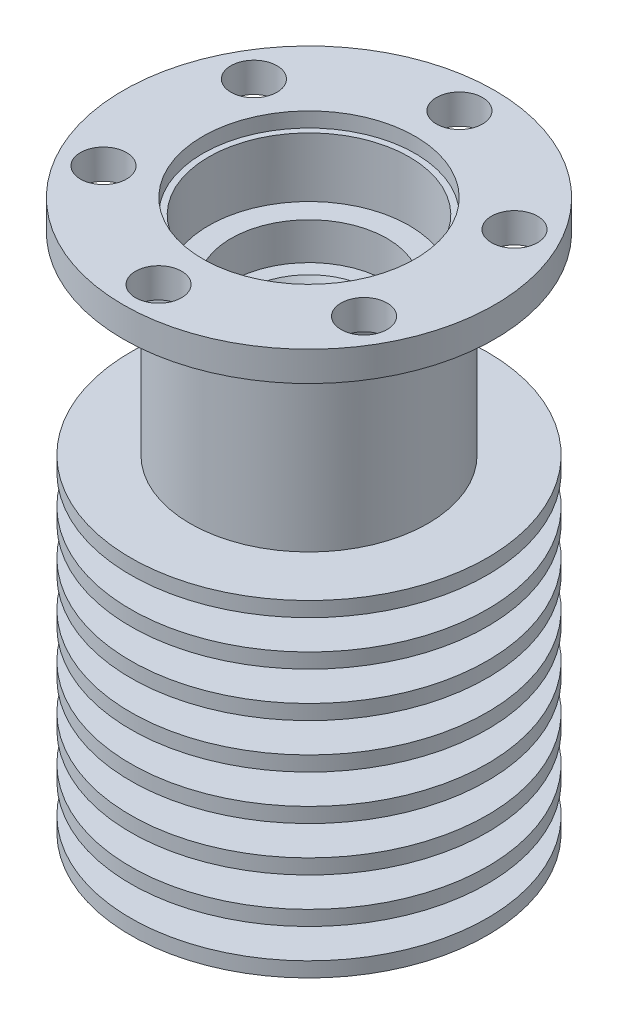
ISO-10303-21;
HEADER;
FILE_DESCRIPTION(('STEP AP214'),'2;1');
FILE_NAME('part.step','',(''),(''),'','','');
FILE_SCHEMA(('AUTOMOTIVE_DESIGN { 1 0 10303 214 1 1 1 1 }'));
ENDSEC;
DATA;
#1=APPLICATION_CONTEXT('core data for automotive mechanical design processes');
#2=APPLICATION_PROTOCOL_DEFINITION('international standard','automotive_design',2000,#1);
#3=PRODUCT_CONTEXT('',#1,'mechanical');
#4=PRODUCT('Part','Part','',(#3));
#5=PRODUCT_RELATED_PRODUCT_CATEGORY('part','',(#4));
#6=PRODUCT_DEFINITION_FORMATION('','',#4);
#7=PRODUCT_DEFINITION_CONTEXT('part definition',#1,'design');
#8=PRODUCT_DEFINITION('design','',#6,#7);
#9=PRODUCT_DEFINITION_SHAPE('','',#8);
#10=(LENGTH_UNIT() NAMED_UNIT(*) SI_UNIT(.MILLI.,.METRE.));
#11=(NAMED_UNIT(*) PLANE_ANGLE_UNIT() SI_UNIT($,.RADIAN.));
#12=(NAMED_UNIT(*) SI_UNIT($,.STERADIAN.) SOLID_ANGLE_UNIT());
#13=UNCERTAINTY_MEASURE_WITH_UNIT(LENGTH_MEASURE(1.E-05),#10,'distance_accuracy_value','');
#14=(GEOMETRIC_REPRESENTATION_CONTEXT(3) GLOBAL_UNCERTAINTY_ASSIGNED_CONTEXT((#13)) GLOBAL_UNIT_ASSIGNED_CONTEXT((#10,
#11,#12)) REPRESENTATION_CONTEXT('',''));
#15=CARTESIAN_POINT('',(0.,0.,0.));
#16=DIRECTION('',(0.,0.,1.));
#17=DIRECTION('',(1.,0.,0.));
#18=AXIS2_PLACEMENT_3D('',#15,#16,#17);
#19=CARTESIAN_POINT('',(0.,0.,0.));
#20=DIRECTION('',(0.,-1.,0.));
#21=DIRECTION('',(0.,0.,-1.));
#22=AXIS2_PLACEMENT_3D('',#19,#20,#21);
#23=CYLINDRICAL_SURFACE('',#22,6.75);
#24=CARTESIAN_POINT('',(0.,32.,0.));
#25=DIRECTION('',(0.,-1.,0.));
#26=DIRECTION('',(0.,0.,-1.));
#27=AXIS2_PLACEMENT_3D('',#24,#25,#26);
#28=CIRCLE('',#27,6.75);
#29=CARTESIAN_POINT('',(0.,32.,-6.75));
#30=VERTEX_POINT('',#29);
#31=EDGE_CURVE('E124',#30,#30,#28,.T.);
#32=ORIENTED_EDGE('',*,*,#31,.T.);
#33=EDGE_LOOP('',(#32));
#34=FACE_BOUND('',#33,.T.);
#35=CARTESIAN_POINT('',(0.,36.,0.));
#36=DIRECTION('',(0.,1.,0.));
#37=DIRECTION('',(-1.,0.,0.));
#38=AXIS2_PLACEMENT_3D('',#35,#36,#37);
#39=CIRCLE('',#38,6.75);
#40=CARTESIAN_POINT('',(-6.75,36.,0.));
#41=VERTEX_POINT('',#40);
#42=EDGE_CURVE('E57',#41,#41,#39,.F.);
#43=ORIENTED_EDGE('',*,*,#42,.F.);
#44=EDGE_LOOP('',(#43));
#45=FACE_BOUND('',#44,.T.);
#46=ADVANCED_FACE('F36',(#34,#45),#23,.F.);
#47=CARTESIAN_POINT('',(0.,37.,0.));
#48=DIRECTION('',(0.,1.,0.));
#49=DIRECTION('',(0.,0.,1.));
#50=AXIS2_PLACEMENT_3D('',#47,#48,#49);
#51=CYLINDRICAL_SURFACE('',#50,4.75);
#52=CARTESIAN_POINT('',(0.,21.,0.));
#53=DIRECTION('',(0.,-1.,0.));
#54=DIRECTION('',(0.,0.,-1.));
#55=AXIS2_PLACEMENT_3D('',#52,#53,#54);
#56=CIRCLE('',#55,4.75);
#57=CARTESIAN_POINT('',(0.,21.,-4.75));
#58=VERTEX_POINT('',#57);
#59=EDGE_CURVE('E178',#58,#58,#56,.T.);
#60=ORIENTED_EDGE('',*,*,#59,.T.);
#61=EDGE_LOOP('',(#60));
#62=FACE_BOUND('',#61,.T.);
#63=CARTESIAN_POINT('',(0.,19.,0.));
#64=DIRECTION('',(0.,-1.,0.));
#65=DIRECTION('',(0.,0.,-1.));
#66=AXIS2_PLACEMENT_3D('',#63,#64,#65);
#67=CIRCLE('',#66,4.75);
#68=CARTESIAN_POINT('',(0.,19.,-4.75));
#69=VERTEX_POINT('',#68);
#70=EDGE_CURVE('E67',#69,#69,#67,.T.);
#71=ORIENTED_EDGE('',*,*,#70,.F.);
#72=EDGE_LOOP('',(#71));
#73=FACE_BOUND('',#72,.T.);
#74=ADVANCED_FACE('F296',(#62,#73),#51,.T.);
#75=CARTESIAN_POINT('',(0.,18.,0.));
#76=DIRECTION('',(0.,-1.,0.));
#77=DIRECTION('',(0.,0.,-1.));
#78=AXIS2_PLACEMENT_3D('',#75,#76,#77);
#79=CIRCLE('',#78,4.75);
#80=CARTESIAN_POINT('',(0.,18.,-4.75));
#81=VERTEX_POINT('',#80);
#82=EDGE_CURVE('E162',#81,#81,#79,.T.);
#83=ORIENTED_EDGE('',*,*,#82,.T.);
#84=EDGE_LOOP('',(#83));
#85=FACE_BOUND('',#84,.T.);
#86=CARTESIAN_POINT('',(0.,16.,0.));
#87=DIRECTION('',(0.,-1.,0.));
#88=DIRECTION('',(0.,0.,-1.));
#89=AXIS2_PLACEMENT_3D('',#86,#87,#88);
#90=CIRCLE('',#89,4.75);
#91=CARTESIAN_POINT('',(0.,16.,-4.75));
#92=VERTEX_POINT('',#91);
#93=EDGE_CURVE('E71',#92,#92,#90,.T.);
#94=ORIENTED_EDGE('',*,*,#93,.F.);
#95=EDGE_LOOP('',(#94));
#96=FACE_BOUND('',#95,.T.);
#97=ADVANCED_FACE('F302',(#85,#96),#51,.T.);
#98=CARTESIAN_POINT('',(0.,15.,0.));
#99=DIRECTION('',(0.,-1.,0.));
#100=DIRECTION('',(0.,0.,-1.));
#101=AXIS2_PLACEMENT_3D('',#98,#99,#100);
#102=CIRCLE('',#101,4.75);
#103=CARTESIAN_POINT('',(0.,15.,-4.75));
#104=VERTEX_POINT('',#103);
#105=EDGE_CURVE('E151',#104,#104,#102,.T.);
#106=ORIENTED_EDGE('',*,*,#105,.T.);
#107=EDGE_LOOP('',(#106));
#108=FACE_BOUND('',#107,.T.);
#109=CARTESIAN_POINT('',(0.,13.,0.));
#110=DIRECTION('',(0.,-1.,0.));
#111=DIRECTION('',(0.,0.,-1.));
#112=AXIS2_PLACEMENT_3D('',#109,#110,#111);
#113=CIRCLE('',#112,4.75);
#114=CARTESIAN_POINT('',(0.,13.,-4.75));
#115=VERTEX_POINT('',#114);
#116=EDGE_CURVE('E68',#115,#115,#113,.T.);
#117=ORIENTED_EDGE('',*,*,#116,.F.);
#118=EDGE_LOOP('',(#117));
#119=FACE_BOUND('',#118,.T.);
#120=ADVANCED_FACE('F305',(#108,#119),#51,.T.);
#121=CARTESIAN_POINT('',(0.,37.,0.));
#122=DIRECTION('',(0.,1.,0.));
#123=DIRECTION('',(0.,0.,1.));
#124=AXIS2_PLACEMENT_3D('',#121,#122,#123);
#125=CYLINDRICAL_SURFACE('',#124,5.25);
#126=CARTESIAN_POINT('',(0.,12.,0.));
#127=DIRECTION('',(0.,1.,0.));
#128=DIRECTION('',(0.,0.,1.));
#129=AXIS2_PLACEMENT_3D('',#126,#127,#128);
#130=CIRCLE('',#129,5.25);
#131=CARTESIAN_POINT('',(0.,12.,5.25));
#132=VERTEX_POINT('',#131);
#133=EDGE_CURVE('E97',#132,#132,#130,.T.);
#134=ORIENTED_EDGE('',*,*,#133,.F.);
#135=EDGE_LOOP('',(#134));
#136=FACE_BOUND('',#135,.T.);
#137=CARTESIAN_POINT('',(0.,10.,0.));
#138=DIRECTION('',(0.,-1.,0.));
#139=DIRECTION('',(0.,0.,-1.));
#140=AXIS2_PLACEMENT_3D('',#137,#138,#139);
#141=CIRCLE('',#140,5.25);
#142=CARTESIAN_POINT('',(0.,10.,-5.25));
#143=VERTEX_POINT('',#142);
#144=EDGE_CURVE('E72',#143,#143,#141,.T.);
#145=ORIENTED_EDGE('',*,*,#144,.F.);
#146=EDGE_LOOP('',(#145));
#147=FACE_BOUND('',#146,.T.);
#148=ADVANCED_FACE('F346',(#136,#147),#125,.T.);
#149=CARTESIAN_POINT('',(0.,37.,0.));
#150=DIRECTION('',(0.,1.,0.));
#151=DIRECTION('',(0.,0.,1.));
#152=AXIS2_PLACEMENT_3D('',#149,#150,#151);
#153=CYLINDRICAL_SURFACE('',#152,6.);
#154=CARTESIAN_POINT('',(0.,9.,0.));
#155=DIRECTION('',(0.,1.,0.));
#156=DIRECTION('',(0.,0.,1.));
#157=AXIS2_PLACEMENT_3D('',#154,#155,#156);
#158=CIRCLE('',#157,6.);
#159=CARTESIAN_POINT('',(0.,9.,6.));
#160=VERTEX_POINT('',#159);
#161=EDGE_CURVE('E94',#160,#160,#158,.T.);
#162=ORIENTED_EDGE('',*,*,#161,.F.);
#163=EDGE_LOOP('',(#162));
#164=FACE_BOUND('',#163,.T.);
#165=CARTESIAN_POINT('',(0.,7.,0.));
#166=DIRECTION('',(0.,-1.,0.));
#167=DIRECTION('',(0.,0.,-1.));
#168=AXIS2_PLACEMENT_3D('',#165,#166,#167);
#169=CIRCLE('',#168,6.);
#170=CARTESIAN_POINT('',(0.,7.,-6.));
#171=VERTEX_POINT('',#170);
#172=EDGE_CURVE('E75',#171,#171,#169,.T.);
#173=ORIENTED_EDGE('',*,*,#172,.F.);
#174=EDGE_LOOP('',(#173));
#175=FACE_BOUND('',#174,.T.);
#176=ADVANCED_FACE('F350',(#164,#175),#153,.T.);
#177=CARTESIAN_POINT('',(0.,6.,0.));
#178=DIRECTION('',(0.,-1.,0.));
#179=DIRECTION('',(0.,0.,-1.));
#180=AXIS2_PLACEMENT_3D('',#177,#178,#179);
#181=CIRCLE('',#180,6.);
#182=CARTESIAN_POINT('',(0.,6.,-6.));
#183=VERTEX_POINT('',#182);
#184=EDGE_CURVE('E79',#183,#183,#181,.T.);
#185=ORIENTED_EDGE('',*,*,#184,.T.);
#186=EDGE_LOOP('',(#185));
#187=FACE_BOUND('',#186,.T.);
#188=CARTESIAN_POINT('',(0.,4.,0.));
#189=DIRECTION('',(0.,-1.,0.));
#190=DIRECTION('',(0.,0.,-1.));
#191=AXIS2_PLACEMENT_3D('',#188,#189,#190);
#192=CIRCLE('',#191,6.);
#193=CARTESIAN_POINT('',(0.,4.,-6.));
#194=VERTEX_POINT('',#193);
#195=EDGE_CURVE('E78',#194,#194,#192,.T.);
#196=ORIENTED_EDGE('',*,*,#195,.F.);
#197=EDGE_LOOP('',(#196));
#198=FACE_BOUND('',#197,.T.);
#199=ADVANCED_FACE('F354',(#187,#198),#153,.T.);
#200=CARTESIAN_POINT('',(0.,3.,0.));
#201=DIRECTION('',(0.,-1.,0.));
#202=DIRECTION('',(0.,0.,-1.));
#203=AXIS2_PLACEMENT_3D('',#200,#201,#202);
#204=CIRCLE('',#203,6.);
#205=CARTESIAN_POINT('',(0.,3.,-6.));
#206=VERTEX_POINT('',#205);
#207=EDGE_CURVE('E87',#206,#206,#204,.T.);
#208=ORIENTED_EDGE('',*,*,#207,.T.);
#209=EDGE_LOOP('',(#208));
#210=FACE_BOUND('',#209,.T.);
#211=CARTESIAN_POINT('',(0.,1.,0.));
#212=DIRECTION('',(0.,-1.,0.));
#213=DIRECTION('',(0.,0.,-1.));
#214=AXIS2_PLACEMENT_3D('',#211,#212,#213);
#215=CIRCLE('',#214,6.);
#216=CARTESIAN_POINT('',(0.,1.,-6.));
#217=VERTEX_POINT('',#216);
#218=EDGE_CURVE('E86',#217,#217,#215,.T.);
#219=ORIENTED_EDGE('',*,*,#218,.F.);
#220=EDGE_LOOP('',(#219));
#221=FACE_BOUND('',#220,.T.);
#222=ADVANCED_FACE('F273',(#210,#221),#153,.T.);
#223=CARTESIAN_POINT('',(0.,37.,0.));
#224=DIRECTION('',(0.,1.,0.));
#225=DIRECTION('',(0.,0.,1.));
#226=AXIS2_PLACEMENT_3D('',#223,#224,#225);
#227=CYLINDRICAL_SURFACE('',#226,8.);
#228=CARTESIAN_POINT('',(0.,35.,0.));
#229=DIRECTION('',(0.,1.,0.));
#230=DIRECTION('',(0.,0.,1.));
#231=AXIS2_PLACEMENT_3D('',#228,#229,#230);
#232=CIRCLE('',#231,8.);
#233=CARTESIAN_POINT('',(0.,35.,8.));
#234=VERTEX_POINT('',#233);
#235=EDGE_CURVE('E100',#234,#234,#232,.T.);
#236=ORIENTED_EDGE('',*,*,#235,.F.);
#237=EDGE_LOOP('',(#236));
#238=FACE_BOUND('',#237,.T.);
#239=CARTESIAN_POINT('',(0.,22.,0.));
#240=DIRECTION('',(0.,-1.,0.));
#241=DIRECTION('',(0.,0.,-1.));
#242=AXIS2_PLACEMENT_3D('',#239,#240,#241);
#243=CIRCLE('',#242,8.);
#244=CARTESIAN_POINT('',(0.,22.,-8.));
#245=VERTEX_POINT('',#244);
#246=EDGE_CURVE('E173',#245,#245,#243,.T.);
#247=ORIENTED_EDGE('',*,*,#246,.F.);
#248=EDGE_LOOP('',(#247));
#249=FACE_BOUND('',#248,.T.);
#250=ADVANCED_FACE('F266',(#238,#249),#227,.T.);
#251=CARTESIAN_POINT('',(8.,35.,0.));
#252=DIRECTION('',(0.,1.,0.));
#253=DIRECTION('',(0.,0.,1.));
#254=AXIS2_PLACEMENT_3D('',#251,#252,#253);
#255=PLANE('',#254);
#256=CARTESIAN_POINT('',(8.76850721331738,35.,-5.0625000000001));
#257=DIRECTION('',(0.,1.,0.));
#258=DIRECTION('',(0.,0.,1.));
#259=AXIS2_PLACEMENT_3D('',#256,#257,#258);
#260=CIRCLE('',#259,1.55);
#261=CARTESIAN_POINT('',(8.76850721331738,35.,-3.5125000000001));
#262=VERTEX_POINT('',#261);
#263=EDGE_CURVE('E215',#262,#262,#260,.F.);
#264=ORIENTED_EDGE('',*,*,#263,.F.);
#265=EDGE_LOOP('',(#264));
#266=FACE_BOUND('',#265,.T.);
#267=CARTESIAN_POINT('',(8.76850721331749,35.,5.06249999999992));
#268=DIRECTION('',(0.,1.,0.));
#269=DIRECTION('',(0.,0.,1.));
#270=AXIS2_PLACEMENT_3D('',#267,#268,#269);
#271=CIRCLE('',#270,1.55);
#272=CARTESIAN_POINT('',(8.76850721331749,35.,6.61249999999992));
#273=VERTEX_POINT('',#272);
#274=EDGE_CURVE('E209',#273,#273,#271,.F.);
#275=ORIENTED_EDGE('',*,*,#274,.F.);
#276=EDGE_LOOP('',(#275));
#277=FACE_BOUND('',#276,.T.);
#278=CARTESIAN_POINT('',(0.,35.,10.125));
#279=DIRECTION('',(0.,1.,0.));
#280=DIRECTION('',(0.,0.,1.));
#281=AXIS2_PLACEMENT_3D('',#278,#279,#280);
#282=CIRCLE('',#281,1.55);
#283=CARTESIAN_POINT('',(0.,35.,11.675));
#284=VERTEX_POINT('',#283);
#285=EDGE_CURVE('E203',#284,#284,#282,.F.);
#286=ORIENTED_EDGE('',*,*,#285,.F.);
#287=EDGE_LOOP('',(#286));
#288=FACE_BOUND('',#287,.T.);
#289=CARTESIAN_POINT('',(-8.76850721331742,35.,5.06250000000004));
#290=DIRECTION('',(0.,1.,0.));
#291=DIRECTION('',(0.,0.,1.));
#292=AXIS2_PLACEMENT_3D('',#289,#290,#291);
#293=CIRCLE('',#292,1.55);
#294=CARTESIAN_POINT('',(-8.76850721331742,35.,6.61250000000004));
#295=VERTEX_POINT('',#294);
#296=EDGE_CURVE('E197',#295,#295,#293,.F.);
#297=ORIENTED_EDGE('',*,*,#296,.F.);
#298=EDGE_LOOP('',(#297));
#299=FACE_BOUND('',#298,.T.);
#300=CARTESIAN_POINT('',(-8.76850721331745,35.,-5.06249999999998));
#301=DIRECTION('',(0.,1.,0.));
#302=DIRECTION('',(0.,0.,1.));
#303=AXIS2_PLACEMENT_3D('',#300,#301,#302);
#304=CIRCLE('',#303,1.55);
#305=CARTESIAN_POINT('',(-8.76850721331745,35.,-3.51249999999998));
#306=VERTEX_POINT('',#305);
#307=EDGE_CURVE('E191',#306,#306,#304,.F.);
#308=ORIENTED_EDGE('',*,*,#307,.F.);
#309=EDGE_LOOP('',(#308));
#310=FACE_BOUND('',#309,.T.);
#311=CARTESIAN_POINT('',(0.,35.,-10.125));
#312=DIRECTION('',(0.,1.,0.));
#313=DIRECTION('',(0.,0.,1.));
#314=AXIS2_PLACEMENT_3D('',#311,#312,#313);
#315=CIRCLE('',#314,1.55);
#316=CARTESIAN_POINT('',(0.,35.,-8.575));
#317=VERTEX_POINT('',#316);
#318=EDGE_CURVE('E185',#317,#317,#315,.F.);
#319=ORIENTED_EDGE('',*,*,#318,.F.);
#320=EDGE_LOOP('',(#319));
#321=FACE_BOUND('',#320,.T.);
#322=CARTESIAN_POINT('',(0.,35.,0.));
#323=DIRECTION('',(0.,1.,0.));
#324=DIRECTION('',(0.,0.,1.));
#325=AXIS2_PLACEMENT_3D('',#322,#323,#324);
#326=CIRCLE('',#325,12.5);
#327=CARTESIAN_POINT('',(0.,35.,12.5));
#328=VERTEX_POINT('',#327);
#329=EDGE_CURVE('E103',#328,#328,#326,.T.);
#330=ORIENTED_EDGE('',*,*,#329,.F.);
#331=EDGE_LOOP('',(#330));
#332=FACE_BOUND('',#331,.T.);
#333=ORIENTED_EDGE('',*,*,#235,.T.);
#334=EDGE_LOOP('',(#333));
#335=FACE_BOUND('',#334,.T.);
#336=ADVANCED_FACE('F260',(#266,#277,#288,#299,#310,#321,#332,#335),#255,.F.);
#337=CARTESIAN_POINT('',(0.,37.,0.));
#338=DIRECTION('',(0.,1.,0.));
#339=DIRECTION('',(0.,0.,1.));
#340=AXIS2_PLACEMENT_3D('',#337,#338,#339);
#341=CYLINDRICAL_SURFACE('',#340,12.5);
#342=CARTESIAN_POINT('',(0.,37.,0.));
#343=DIRECTION('',(0.,1.,0.));
#344=DIRECTION('',(0.,0.,1.));
#345=AXIS2_PLACEMENT_3D('',#342,#343,#344);
#346=CIRCLE('',#345,12.5);
#347=CARTESIAN_POINT('',(0.,37.,12.5));
#348=VERTEX_POINT('',#347);
#349=EDGE_CURVE('E106',#348,#348,#346,.T.);
#350=ORIENTED_EDGE('',*,*,#349,.F.);
#351=EDGE_LOOP('',(#350));
#352=FACE_BOUND('',#351,.T.);
#353=ORIENTED_EDGE('',*,*,#329,.T.);
#354=EDGE_LOOP('',(#353));
#355=FACE_BOUND('',#354,.T.);
#356=ADVANCED_FACE('F242',(#352,#355),#341,.T.);
#357=CARTESIAN_POINT('',(12.5,37.,0.));
#358=DIRECTION('',(0.,-1.,0.));
#359=DIRECTION('',(0.,0.,-1.));
#360=AXIS2_PLACEMENT_3D('',#357,#358,#359);
#361=PLANE('',#360);
#362=CARTESIAN_POINT('',(0.,37.,0.));
#363=DIRECTION('',(0.,1.,0.));
#364=DIRECTION('',(-1.,0.,0.));
#365=AXIS2_PLACEMENT_3D('',#362,#363,#364);
#366=CIRCLE('',#365,7.15);
#367=CARTESIAN_POINT('',(-7.15,37.,0.));
#368=VERTEX_POINT('',#367);
#369=EDGE_CURVE('E222',#368,#368,#366,.T.);
#370=ORIENTED_EDGE('',*,*,#369,.F.);
#371=EDGE_LOOP('',(#370));
#372=FACE_BOUND('',#371,.T.);
#373=CARTESIAN_POINT('',(8.76850721331738,37.,-5.0625000000001));
#374=DIRECTION('',(0.,1.,0.));
#375=DIRECTION('',(-0.50000000000001,0.,-0.866025403784433));
#376=AXIS2_PLACEMENT_3D('',#373,#374,#375);
#377=CIRCLE('',#376,1.55);
#378=CARTESIAN_POINT('',(7.99350721331737,37.,-6.40483937586597));
#379=VERTEX_POINT('',#378);
#380=EDGE_CURVE('E60',#379,#379,#377,.T.);
#381=ORIENTED_EDGE('',*,*,#380,.F.);
#382=EDGE_LOOP('',(#381));
#383=FACE_BOUND('',#382,.T.);
#384=CARTESIAN_POINT('',(8.76850721331749,37.,5.06249999999992));
#385=DIRECTION('',(0.,1.,0.));
#386=DIRECTION('',(0.499999999999992,0.,-0.866025403784443));
#387=AXIS2_PLACEMENT_3D('',#384,#385,#386);
#388=CIRCLE('',#387,1.55);
#389=CARTESIAN_POINT('',(9.54350721331748,37.,3.72016062413403));
#390=VERTEX_POINT('',#389);
#391=EDGE_CURVE('E212',#390,#390,#388,.T.);
#392=ORIENTED_EDGE('',*,*,#391,.F.);
#393=EDGE_LOOP('',(#392));
#394=FACE_BOUND('',#393,.T.);
#395=CARTESIAN_POINT('',(0.,37.,10.125));
#396=DIRECTION('',(0.,1.,0.));
#397=DIRECTION('',(1.,0.,0.));
#398=AXIS2_PLACEMENT_3D('',#395,#396,#397);
#399=CIRCLE('',#398,1.55);
#400=CARTESIAN_POINT('',(1.55,37.,10.125));
#401=VERTEX_POINT('',#400);
#402=EDGE_CURVE('E206',#401,#401,#399,.T.);
#403=ORIENTED_EDGE('',*,*,#402,.F.);
#404=EDGE_LOOP('',(#403));
#405=FACE_BOUND('',#404,.T.);
#406=CARTESIAN_POINT('',(-8.76850721331742,37.,5.06250000000004));
#407=DIRECTION('',(0.,1.,0.));
#408=DIRECTION('',(0.500000000000004,0.,0.866025403784436));
#409=AXIS2_PLACEMENT_3D('',#406,#407,#408);
#410=CIRCLE('',#409,1.55);
#411=CARTESIAN_POINT('',(-7.99350721331741,37.,6.40483937586592));
#412=VERTEX_POINT('',#411);
#413=EDGE_CURVE('E200',#412,#412,#410,.T.);
#414=ORIENTED_EDGE('',*,*,#413,.F.);
#415=EDGE_LOOP('',(#414));
#416=FACE_BOUND('',#415,.T.);
#417=CARTESIAN_POINT('',(-8.76850721331745,37.,-5.06249999999998));
#418=DIRECTION('',(0.,1.,0.));
#419=DIRECTION('',(-0.499999999999998,0.,0.86602540378444));
#420=AXIS2_PLACEMENT_3D('',#417,#418,#419);
#421=CIRCLE('',#420,1.55);
#422=CARTESIAN_POINT('',(-9.54350721331745,37.,-3.7201606241341));
#423=VERTEX_POINT('',#422);
#424=EDGE_CURVE('E194',#423,#423,#421,.T.);
#425=ORIENTED_EDGE('',*,*,#424,.F.);
#426=EDGE_LOOP('',(#425));
#427=FACE_BOUND('',#426,.T.);
#428=CARTESIAN_POINT('',(0.,37.,-10.125));
#429=DIRECTION('',(0.,1.,0.));
#430=DIRECTION('',(-1.,0.,0.));
#431=AXIS2_PLACEMENT_3D('',#428,#429,#430);
#432=CIRCLE('',#431,1.55);
#433=CARTESIAN_POINT('',(-1.55,37.,-10.125));
#434=VERTEX_POINT('',#433);
#435=EDGE_CURVE('E188',#434,#434,#432,.T.);
#436=ORIENTED_EDGE('',*,*,#435,.F.);
#437=EDGE_LOOP('',(#436));
#438=FACE_BOUND('',#437,.T.);
#439=ORIENTED_EDGE('',*,*,#349,.T.);
#440=EDGE_LOOP('',(#439));
#441=FACE_BOUND('',#440,.T.);
#442=ADVANCED_FACE('F238',(#372,#383,#394,#405,#416,#427,#438,#441),#361,.F.);
#443=CARTESIAN_POINT('',(0.,0.,0.));
#444=DIRECTION('',(0.,1.,0.));
#445=DIRECTION('',(0.,0.,1.));
#446=AXIS2_PLACEMENT_3D('',#443,#444,#445);
#447=PLANE('',#446);
#448=CARTESIAN_POINT('',(0.,0.,0.));
#449=DIRECTION('',(0.,-1.,0.));
#450=DIRECTION('',(0.,0.,-1.));
#451=AXIS2_PLACEMENT_3D('',#448,#449,#450);
#452=CIRCLE('',#451,2.5);
#453=CARTESIAN_POINT('',(0.,0.,-2.5));
#454=VERTEX_POINT('',#453);
#455=EDGE_CURVE('E109',#454,#454,#452,.T.);
#456=ORIENTED_EDGE('',*,*,#455,.F.);
#457=EDGE_LOOP('',(#456));
#458=FACE_BOUND('',#457,.T.);
#459=CARTESIAN_POINT('',(0.,0.,0.));
#460=DIRECTION('',(0.,-1.,0.));
#461=DIRECTION('',(0.,0.,-1.));
#462=AXIS2_PLACEMENT_3D('',#459,#460,#461);
#463=CIRCLE('',#462,12.);
#464=CARTESIAN_POINT('',(0.,0.,-12.));
#465=VERTEX_POINT('',#464);
#466=EDGE_CURVE('E90',#465,#465,#463,.T.);
#467=ORIENTED_EDGE('',*,*,#466,.T.);
#468=EDGE_LOOP('',(#467));
#469=FACE_BOUND('',#468,.T.);
#470=ADVANCED_FACE('F241',(#458,#469),#447,.F.);
#471=CARTESIAN_POINT('',(0.,0.,0.));
#472=DIRECTION('',(0.,-1.,0.));
#473=DIRECTION('',(0.,0.,-1.));
#474=AXIS2_PLACEMENT_3D('',#471,#472,#473);
#475=CYLINDRICAL_SURFACE('',#474,2.5);
#476=CARTESIAN_POINT('',(0.,12.,0.));
#477=DIRECTION('',(0.,-1.,0.));
#478=DIRECTION('',(0.,0.,-1.));
#479=AXIS2_PLACEMENT_3D('',#476,#477,#478);
#480=CIRCLE('',#479,2.5);
#481=CARTESIAN_POINT('',(0.,12.,-2.5));
#482=VERTEX_POINT('',#481);
#483=EDGE_CURVE('E112',#482,#482,#480,.T.);
#484=ORIENTED_EDGE('',*,*,#483,.F.);
#485=EDGE_LOOP('',(#484));
#486=FACE_BOUND('',#485,.T.);
#487=ORIENTED_EDGE('',*,*,#455,.T.);
#488=EDGE_LOOP('',(#487));
#489=FACE_BOUND('',#488,.T.);
#490=ADVANCED_FACE('F337',(#486,#489),#475,.F.);
#491=CARTESIAN_POINT('',(2.5,12.,0.));
#492=DIRECTION('',(0.,1.,0.));
#493=DIRECTION('',(0.,0.,1.));
#494=AXIS2_PLACEMENT_3D('',#491,#492,#493);
#495=PLANE('',#494);
#496=CARTESIAN_POINT('',(0.,12.,0.));
#497=DIRECTION('',(0.,1.,0.));
#498=DIRECTION('',(0.,0.,1.));
#499=AXIS2_PLACEMENT_3D('',#496,#497,#498);
#500=CIRCLE('',#499,1.85);
#501=CARTESIAN_POINT('',(0.,12.,1.85));
#502=VERTEX_POINT('',#501);
#503=EDGE_CURVE('E47',#502,#502,#500,.T.);
#504=ORIENTED_EDGE('',*,*,#503,.T.);
#505=EDGE_LOOP('',(#504));
#506=FACE_BOUND('',#505,.T.);
#507=ORIENTED_EDGE('',*,*,#483,.T.);
#508=EDGE_LOOP('',(#507));
#509=FACE_BOUND('',#508,.T.);
#510=ADVANCED_FACE('F333',(#506,#509),#495,.F.);
#511=CARTESIAN_POINT('',(0.,0.,0.));
#512=DIRECTION('',(0.,-1.,0.));
#513=DIRECTION('',(0.,0.,-1.));
#514=AXIS2_PLACEMENT_3D('',#511,#512,#513);
#515=CYLINDRICAL_SURFACE('',#514,1.7);
#516=CARTESIAN_POINT('',(0.,12.2598076211353,0.));
#517=DIRECTION('',(0.,1.,0.));
#518=DIRECTION('',(0.,0.,1.));
#519=AXIS2_PLACEMENT_3D('',#516,#517,#518);
#520=CIRCLE('',#519,1.7);
#521=CARTESIAN_POINT('',(0.,12.2598076211353,1.7));
#522=VERTEX_POINT('',#521);
#523=EDGE_CURVE('E51',#522,#522,#520,.F.);
#524=ORIENTED_EDGE('',*,*,#523,.T.);
#525=EDGE_LOOP('',(#524));
#526=FACE_BOUND('',#525,.T.);
#527=CARTESIAN_POINT('',(0.,13.4803847577293,0.));
#528=DIRECTION('',(0.,-1.,0.));
#529=DIRECTION('',(0.,0.,-1.));
#530=AXIS2_PLACEMENT_3D('',#527,#528,#529);
#531=CIRCLE('',#530,1.7);
#532=CARTESIAN_POINT('',(0.,13.4803847577293,-1.7));
#533=VERTEX_POINT('',#532);
#534=EDGE_CURVE('E56',#533,#533,#531,.F.);
#535=ORIENTED_EDGE('',*,*,#534,.T.);
#536=EDGE_LOOP('',(#535));
#537=FACE_BOUND('',#536,.T.);
#538=ADVANCED_FACE('F329',(#526,#537),#515,.F.);
#539=CARTESIAN_POINT('',(1.7,14.,0.));
#540=DIRECTION('',(0.,-1.,0.));
#541=DIRECTION('',(0.,0.,-1.));
#542=AXIS2_PLACEMENT_3D('',#539,#540,#541);
#543=PLANE('',#542);
#544=CARTESIAN_POINT('',(0.,14.,0.));
#545=DIRECTION('',(0.,-1.,0.));
#546=DIRECTION('',(0.,0.,-1.));
#547=AXIS2_PLACEMENT_3D('',#544,#545,#546);
#548=CIRCLE('',#547,2.00000000000001);
#549=CARTESIAN_POINT('',(0.,14.,-2.00000000000001));
#550=VERTEX_POINT('',#549);
#551=EDGE_CURVE('E64',#550,#550,#548,.T.);
#552=ORIENTED_EDGE('',*,*,#551,.T.);
#553=EDGE_LOOP('',(#552));
#554=FACE_BOUND('',#553,.T.);
#555=CARTESIAN_POINT('',(0.,14.,0.));
#556=DIRECTION('',(0.,-1.,0.));
#557=DIRECTION('',(0.,0.,-1.));
#558=AXIS2_PLACEMENT_3D('',#555,#556,#557);
#559=CIRCLE('',#558,3.25);
#560=CARTESIAN_POINT('',(0.,14.,-3.25));
#561=VERTEX_POINT('',#560);
#562=EDGE_CURVE('E115',#561,#561,#559,.T.);
#563=ORIENTED_EDGE('',*,*,#562,.F.);
#564=EDGE_LOOP('',(#563));
#565=FACE_BOUND('',#564,.T.);
#566=ADVANCED_FACE('F326',(#554,#565),#543,.F.);
#567=CARTESIAN_POINT('',(0.,0.,0.));
#568=DIRECTION('',(0.,-1.,0.));
#569=DIRECTION('',(0.,0.,-1.));
#570=AXIS2_PLACEMENT_3D('',#567,#568,#569);
#571=CYLINDRICAL_SURFACE('',#570,3.25);
#572=CARTESIAN_POINT('',(0.,27.7679491924311,0.));
#573=DIRECTION('',(0.,-1.,0.));
#574=DIRECTION('',(0.,0.,-1.));
#575=AXIS2_PLACEMENT_3D('',#572,#573,#574);
#576=CIRCLE('',#575,3.25);
#577=CARTESIAN_POINT('',(0.,27.7679491924311,-3.25));
#578=VERTEX_POINT('',#577);
#579=EDGE_CURVE('E10',#578,#578,#576,.F.);
#580=ORIENTED_EDGE('',*,*,#579,.T.);
#581=EDGE_LOOP('',(#580));
#582=FACE_BOUND('',#581,.T.);
#583=ORIENTED_EDGE('',*,*,#562,.T.);
#584=EDGE_LOOP('',(#583));
#585=FACE_BOUND('',#584,.T.);
#586=ADVANCED_FACE('F323',(#582,#585),#571,.F.);
#587=CARTESIAN_POINT('',(3.25,29.5,0.));
#588=DIRECTION('',(0.,-1.,0.));
#589=DIRECTION('',(0.,0.,-1.));
#590=AXIS2_PLACEMENT_3D('',#587,#588,#589);
#591=PLANE('',#590);
#592=CARTESIAN_POINT('',(0.,29.5,0.));
#593=DIRECTION('',(0.,-1.,0.));
#594=DIRECTION('',(0.,0.,-1.));
#595=AXIS2_PLACEMENT_3D('',#592,#593,#594);
#596=CIRCLE('',#595,4.25000000000001);
#597=CARTESIAN_POINT('',(0.,29.5,-4.25000000000001));
#598=VERTEX_POINT('',#597);
#599=EDGE_CURVE('E43',#598,#598,#596,.T.);
#600=ORIENTED_EDGE('',*,*,#599,.T.);
#601=EDGE_LOOP('',(#600));
#602=FACE_BOUND('',#601,.T.);
#603=CARTESIAN_POINT('',(0.,29.5,0.));
#604=DIRECTION('',(0.,-1.,0.));
#605=DIRECTION('',(0.,0.,-1.));
#606=AXIS2_PLACEMENT_3D('',#603,#604,#605);
#607=CIRCLE('',#606,5.25);
#608=CARTESIAN_POINT('',(0.,29.5,-5.25));
#609=VERTEX_POINT('',#608);
#610=EDGE_CURVE('E118',#609,#609,#607,.T.);
#611=ORIENTED_EDGE('',*,*,#610,.F.);
#612=EDGE_LOOP('',(#611));
#613=FACE_BOUND('',#612,.T.);
#614=ADVANCED_FACE('F319',(#602,#613),#591,.F.);
#615=CARTESIAN_POINT('',(0.,0.,0.));
#616=DIRECTION('',(0.,-1.,0.));
#617=DIRECTION('',(0.,0.,-1.));
#618=AXIS2_PLACEMENT_3D('',#615,#616,#617);
#619=CYLINDRICAL_SURFACE('',#618,5.25);
#620=CARTESIAN_POINT('',(0.,32.,0.));
#621=DIRECTION('',(0.,-1.,0.));
#622=DIRECTION('',(0.,0.,-1.));
#623=AXIS2_PLACEMENT_3D('',#620,#621,#622);
#624=CIRCLE('',#623,5.25);
#625=CARTESIAN_POINT('',(0.,32.,-5.25));
#626=VERTEX_POINT('',#625);
#627=EDGE_CURVE('E121',#626,#626,#624,.T.);
#628=ORIENTED_EDGE('',*,*,#627,.F.);
#629=EDGE_LOOP('',(#628));
#630=FACE_BOUND('',#629,.T.);
#631=ORIENTED_EDGE('',*,*,#610,.T.);
#632=EDGE_LOOP('',(#631));
#633=FACE_BOUND('',#632,.T.);
#634=ADVANCED_FACE('F315',(#630,#633),#619,.F.);
#635=CARTESIAN_POINT('',(5.25,32.,0.));
#636=DIRECTION('',(0.,-1.,0.));
#637=DIRECTION('',(0.,0.,-1.));
#638=AXIS2_PLACEMENT_3D('',#635,#636,#637);
#639=PLANE('',#638);
#640=ORIENTED_EDGE('',*,*,#31,.F.);
#641=EDGE_LOOP('',(#640));
#642=FACE_BOUND('',#641,.T.);
#643=ORIENTED_EDGE('',*,*,#627,.T.);
#644=EDGE_LOOP('',(#643));
#645=FACE_BOUND('',#644,.T.);
#646=ADVANCED_FACE('F311',(#642,#645),#639,.F.);
#647=CARTESIAN_POINT('',(0.,1.,0.));
#648=DIRECTION('',(0.,-1.,0.));
#649=DIRECTION('',(0.,0.,-1.));
#650=AXIS2_PLACEMENT_3D('',#647,#648,#649);
#651=PLANE('',#650);
#652=CARTESIAN_POINT('',(0.,1.,0.));
#653=DIRECTION('',(0.,-1.,0.));
#654=DIRECTION('',(0.,0.,-1.));
#655=AXIS2_PLACEMENT_3D('',#652,#653,#654);
#656=CIRCLE('',#655,12.);
#657=CARTESIAN_POINT('',(0.,1.,-12.));
#658=VERTEX_POINT('',#657);
#659=EDGE_CURVE('E127',#658,#658,#656,.T.);
#660=ORIENTED_EDGE('',*,*,#659,.F.);
#661=EDGE_LOOP('',(#660));
#662=FACE_BOUND('',#661,.T.);
#663=ORIENTED_EDGE('',*,*,#218,.T.);
#664=EDGE_LOOP('',(#663));
#665=FACE_BOUND('',#664,.T.);
#666=ADVANCED_FACE('F314',(#662,#665),#651,.F.);
#667=CARTESIAN_POINT('',(0.,1.,0.));
#668=DIRECTION('',(0.,-1.,0.));
#669=DIRECTION('',(0.,0.,-1.));
#670=AXIS2_PLACEMENT_3D('',#667,#668,#669);
#671=CYLINDRICAL_SURFACE('',#670,12.);
#672=ORIENTED_EDGE('',*,*,#659,.T.);
#673=EDGE_LOOP('',(#672));
#674=FACE_BOUND('',#673,.T.);
#675=ORIENTED_EDGE('',*,*,#466,.F.);
#676=EDGE_LOOP('',(#675));
#677=FACE_BOUND('',#676,.T.);
#678=ADVANCED_FACE('F309',(#674,#677),#671,.T.);
#679=CARTESIAN_POINT('',(0.,4.,0.));
#680=DIRECTION('',(0.,-1.,0.));
#681=DIRECTION('',(0.,0.,-1.));
#682=AXIS2_PLACEMENT_3D('',#679,#680,#681);
#683=PLANE('',#682);
#684=CARTESIAN_POINT('',(0.,4.,0.));
#685=DIRECTION('',(0.,-1.,0.));
#686=DIRECTION('',(0.,0.,-1.));
#687=AXIS2_PLACEMENT_3D('',#684,#685,#686);
#688=CIRCLE('',#687,12.);
#689=CARTESIAN_POINT('',(0.,4.,-12.));
#690=VERTEX_POINT('',#689);
#691=EDGE_CURVE('E91',#690,#690,#688,.T.);
#692=ORIENTED_EDGE('',*,*,#691,.F.);
#693=EDGE_LOOP('',(#692));
#694=FACE_BOUND('',#693,.T.);
#695=ORIENTED_EDGE('',*,*,#195,.T.);
#696=EDGE_LOOP('',(#695));
#697=FACE_BOUND('',#696,.T.);
#698=ADVANCED_FACE('F384',(#694,#697),#683,.F.);
#699=CARTESIAN_POINT('',(0.,3.,0.));
#700=DIRECTION('',(0.,-1.,0.));
#701=DIRECTION('',(0.,0.,-1.));
#702=AXIS2_PLACEMENT_3D('',#699,#700,#701);
#703=PLANE('',#702);
#704=CARTESIAN_POINT('',(0.,3.,0.));
#705=DIRECTION('',(0.,-1.,0.));
#706=DIRECTION('',(0.,0.,-1.));
#707=AXIS2_PLACEMENT_3D('',#704,#705,#706);
#708=CIRCLE('',#707,12.);
#709=CARTESIAN_POINT('',(0.,3.,-12.));
#710=VERTEX_POINT('',#709);
#711=EDGE_CURVE('E82',#710,#710,#708,.T.);
#712=ORIENTED_EDGE('',*,*,#711,.T.);
#713=EDGE_LOOP('',(#712));
#714=FACE_BOUND('',#713,.T.);
#715=ORIENTED_EDGE('',*,*,#207,.F.);
#716=EDGE_LOOP('',(#715));
#717=FACE_BOUND('',#716,.T.);
#718=ADVANCED_FACE('F390',(#714,#717),#703,.T.);
#719=CARTESIAN_POINT('',(0.,4.,0.));
#720=DIRECTION('',(0.,-1.,0.));
#721=DIRECTION('',(0.,0.,-1.));
#722=AXIS2_PLACEMENT_3D('',#719,#720,#721);
#723=CYLINDRICAL_SURFACE('',#722,12.);
#724=ORIENTED_EDGE('',*,*,#691,.T.);
#725=EDGE_LOOP('',(#724));
#726=FACE_BOUND('',#725,.T.);
#727=ORIENTED_EDGE('',*,*,#711,.F.);
#728=EDGE_LOOP('',(#727));
#729=FACE_BOUND('',#728,.T.);
#730=ADVANCED_FACE('F401',(#726,#729),#723,.T.);
#731=CARTESIAN_POINT('',(0.,7.,0.));
#732=DIRECTION('',(0.,-1.,0.));
#733=DIRECTION('',(0.,0.,-1.));
#734=AXIS2_PLACEMENT_3D('',#731,#732,#733);
#735=PLANE('',#734);
#736=CARTESIAN_POINT('',(0.,7.,0.));
#737=DIRECTION('',(0.,-1.,0.));
#738=DIRECTION('',(0.,0.,-1.));
#739=AXIS2_PLACEMENT_3D('',#736,#737,#738);
#740=CIRCLE('',#739,12.);
#741=CARTESIAN_POINT('',(0.,7.,-12.));
#742=VERTEX_POINT('',#741);
#743=EDGE_CURVE('E83',#742,#742,#740,.T.);
#744=ORIENTED_EDGE('',*,*,#743,.F.);
#745=EDGE_LOOP('',(#744));
#746=FACE_BOUND('',#745,.T.);
#747=ORIENTED_EDGE('',*,*,#172,.T.);
#748=EDGE_LOOP('',(#747));
#749=FACE_BOUND('',#748,.T.);
#750=ADVANCED_FACE('F404',(#746,#749),#735,.F.);
#751=CARTESIAN_POINT('',(0.,6.,0.));
#752=DIRECTION('',(0.,-1.,0.));
#753=DIRECTION('',(0.,0.,-1.));
#754=AXIS2_PLACEMENT_3D('',#751,#752,#753);
#755=PLANE('',#754);
#756=CARTESIAN_POINT('',(0.,6.,0.));
#757=DIRECTION('',(0.,-1.,0.));
#758=DIRECTION('',(0.,0.,-1.));
#759=AXIS2_PLACEMENT_3D('',#756,#757,#758);
#760=CIRCLE('',#759,12.);
#761=CARTESIAN_POINT('',(0.,6.,-12.));
#762=VERTEX_POINT('',#761);
#763=EDGE_CURVE('E136',#762,#762,#760,.T.);
#764=ORIENTED_EDGE('',*,*,#763,.T.);
#765=EDGE_LOOP('',(#764));
#766=FACE_BOUND('',#765,.T.);
#767=ORIENTED_EDGE('',*,*,#184,.F.);
#768=EDGE_LOOP('',(#767));
#769=FACE_BOUND('',#768,.T.);
#770=ADVANCED_FACE('F413',(#766,#769),#755,.T.);
#771=CARTESIAN_POINT('',(0.,7.,0.));
#772=DIRECTION('',(0.,-1.,0.));
#773=DIRECTION('',(0.,0.,-1.));
#774=AXIS2_PLACEMENT_3D('',#771,#772,#773);
#775=CYLINDRICAL_SURFACE('',#774,12.);
#776=ORIENTED_EDGE('',*,*,#743,.T.);
#777=EDGE_LOOP('',(#776));
#778=FACE_BOUND('',#777,.T.);
#779=ORIENTED_EDGE('',*,*,#763,.F.);
#780=EDGE_LOOP('',(#779));
#781=FACE_BOUND('',#780,.T.);
#782=ADVANCED_FACE('F409',(#778,#781),#775,.T.);
#783=CARTESIAN_POINT('',(0.,10.,0.));
#784=DIRECTION('',(0.,-1.,0.));
#785=DIRECTION('',(0.,0.,-1.));
#786=AXIS2_PLACEMENT_3D('',#783,#784,#785);
#787=PLANE('',#786);
#788=CARTESIAN_POINT('',(0.,10.,0.));
#789=DIRECTION('',(0.,-1.,0.));
#790=DIRECTION('',(0.,0.,-1.));
#791=AXIS2_PLACEMENT_3D('',#788,#789,#790);
#792=CIRCLE('',#791,12.);
#793=CARTESIAN_POINT('',(0.,10.,-12.));
#794=VERTEX_POINT('',#793);
#795=EDGE_CURVE('E139',#794,#794,#792,.T.);
#796=ORIENTED_EDGE('',*,*,#795,.F.);
#797=EDGE_LOOP('',(#796));
#798=FACE_BOUND('',#797,.T.);
#799=ORIENTED_EDGE('',*,*,#144,.T.);
#800=EDGE_LOOP('',(#799));
#801=FACE_BOUND('',#800,.T.);
#802=ADVANCED_FACE('F412',(#798,#801),#787,.F.);
#803=CARTESIAN_POINT('',(0.,9.,0.));
#804=DIRECTION('',(0.,-1.,0.));
#805=DIRECTION('',(0.,0.,-1.));
#806=AXIS2_PLACEMENT_3D('',#803,#804,#805);
#807=PLANE('',#806);
#808=CARTESIAN_POINT('',(0.,9.,0.));
#809=DIRECTION('',(0.,-1.,0.));
#810=DIRECTION('',(0.,0.,-1.));
#811=AXIS2_PLACEMENT_3D('',#808,#809,#810);
#812=CIRCLE('',#811,12.);
#813=CARTESIAN_POINT('',(0.,9.,-12.));
#814=VERTEX_POINT('',#813);
#815=EDGE_CURVE('E142',#814,#814,#812,.T.);
#816=ORIENTED_EDGE('',*,*,#815,.T.);
#817=EDGE_LOOP('',(#816));
#818=FACE_BOUND('',#817,.T.);
#819=ORIENTED_EDGE('',*,*,#161,.T.);
#820=EDGE_LOOP('',(#819));
#821=FACE_BOUND('',#820,.T.);
#822=ADVANCED_FACE('F425',(#818,#821),#807,.T.);
#823=CARTESIAN_POINT('',(0.,10.,0.));
#824=DIRECTION('',(0.,-1.,0.));
#825=DIRECTION('',(0.,0.,-1.));
#826=AXIS2_PLACEMENT_3D('',#823,#824,#825);
#827=CYLINDRICAL_SURFACE('',#826,12.);
#828=ORIENTED_EDGE('',*,*,#795,.T.);
#829=EDGE_LOOP('',(#828));
#830=FACE_BOUND('',#829,.T.);
#831=ORIENTED_EDGE('',*,*,#815,.F.);
#832=EDGE_LOOP('',(#831));
#833=FACE_BOUND('',#832,.T.);
#834=ADVANCED_FACE('F421',(#830,#833),#827,.T.);
#835=CARTESIAN_POINT('',(0.,13.,0.));
#836=DIRECTION('',(0.,-1.,0.));
#837=DIRECTION('',(0.,0.,-1.));
#838=AXIS2_PLACEMENT_3D('',#835,#836,#837);
#839=PLANE('',#838);
#840=CARTESIAN_POINT('',(0.,13.,0.));
#841=DIRECTION('',(0.,-1.,0.));
#842=DIRECTION('',(0.,0.,-1.));
#843=AXIS2_PLACEMENT_3D('',#840,#841,#842);
#844=CIRCLE('',#843,12.);
#845=CARTESIAN_POINT('',(0.,13.,-12.));
#846=VERTEX_POINT('',#845);
#847=EDGE_CURVE('E145',#846,#846,#844,.T.);
#848=ORIENTED_EDGE('',*,*,#847,.F.);
#849=EDGE_LOOP('',(#848));
#850=FACE_BOUND('',#849,.T.);
#851=ORIENTED_EDGE('',*,*,#116,.T.);
#852=EDGE_LOOP('',(#851));
#853=FACE_BOUND('',#852,.T.);
#854=ADVANCED_FACE('F424',(#850,#853),#839,.F.);
#855=CARTESIAN_POINT('',(0.,12.,0.));
#856=DIRECTION('',(0.,-1.,0.));
#857=DIRECTION('',(0.,0.,-1.));
#858=AXIS2_PLACEMENT_3D('',#855,#856,#857);
#859=PLANE('',#858);
#860=CARTESIAN_POINT('',(0.,12.,0.));
#861=DIRECTION('',(0.,-1.,0.));
#862=DIRECTION('',(0.,0.,-1.));
#863=AXIS2_PLACEMENT_3D('',#860,#861,#862);
#864=CIRCLE('',#863,12.);
#865=CARTESIAN_POINT('',(0.,12.,-12.));
#866=VERTEX_POINT('',#865);
#867=EDGE_CURVE('E148',#866,#866,#864,.T.);
#868=ORIENTED_EDGE('',*,*,#867,.T.);
#869=EDGE_LOOP('',(#868));
#870=FACE_BOUND('',#869,.T.);
#871=ORIENTED_EDGE('',*,*,#133,.T.);
#872=EDGE_LOOP('',(#871));
#873=FACE_BOUND('',#872,.T.);
#874=ADVANCED_FACE('F437',(#870,#873),#859,.T.);
#875=CARTESIAN_POINT('',(0.,13.,0.));
#876=DIRECTION('',(0.,-1.,0.));
#877=DIRECTION('',(0.,0.,-1.));
#878=AXIS2_PLACEMENT_3D('',#875,#876,#877);
#879=CYLINDRICAL_SURFACE('',#878,12.);
#880=ORIENTED_EDGE('',*,*,#847,.T.);
#881=EDGE_LOOP('',(#880));
#882=FACE_BOUND('',#881,.T.);
#883=ORIENTED_EDGE('',*,*,#867,.F.);
#884=EDGE_LOOP('',(#883));
#885=FACE_BOUND('',#884,.T.);
#886=ADVANCED_FACE('F433',(#882,#885),#879,.T.);
#887=CARTESIAN_POINT('',(0.,16.,0.));
#888=DIRECTION('',(0.,-1.,0.));
#889=DIRECTION('',(0.,0.,-1.));
#890=AXIS2_PLACEMENT_3D('',#887,#888,#889);
#891=PLANE('',#890);
#892=CARTESIAN_POINT('',(0.,16.,0.));
#893=DIRECTION('',(0.,-1.,0.));
#894=DIRECTION('',(0.,0.,-1.));
#895=AXIS2_PLACEMENT_3D('',#892,#893,#894);
#896=CIRCLE('',#895,12.);
#897=CARTESIAN_POINT('',(0.,16.,-12.));
#898=VERTEX_POINT('',#897);
#899=EDGE_CURVE('E158',#898,#898,#896,.T.);
#900=ORIENTED_EDGE('',*,*,#899,.F.);
#901=EDGE_LOOP('',(#900));
#902=FACE_BOUND('',#901,.T.);
#903=ORIENTED_EDGE('',*,*,#93,.T.);
#904=EDGE_LOOP('',(#903));
#905=FACE_BOUND('',#904,.T.);
#906=ADVANCED_FACE('F436',(#902,#905),#891,.F.);
#907=CARTESIAN_POINT('',(0.,15.,0.));
#908=DIRECTION('',(0.,-1.,0.));
#909=DIRECTION('',(0.,0.,-1.));
#910=AXIS2_PLACEMENT_3D('',#907,#908,#909);
#911=PLANE('',#910);
#912=CARTESIAN_POINT('',(0.,15.,0.));
#913=DIRECTION('',(0.,-1.,0.));
#914=DIRECTION('',(0.,0.,-1.));
#915=AXIS2_PLACEMENT_3D('',#912,#913,#914);
#916=CIRCLE('',#915,12.);
#917=CARTESIAN_POINT('',(0.,15.,-12.));
#918=VERTEX_POINT('',#917);
#919=EDGE_CURVE('E159',#918,#918,#916,.T.);
#920=ORIENTED_EDGE('',*,*,#919,.T.);
#921=EDGE_LOOP('',(#920));
#922=FACE_BOUND('',#921,.T.);
#923=ORIENTED_EDGE('',*,*,#105,.F.);
#924=EDGE_LOOP('',(#923));
#925=FACE_BOUND('',#924,.T.);
#926=ADVANCED_FACE('F449',(#922,#925),#911,.T.);
#927=CARTESIAN_POINT('',(0.,16.,0.));
#928=DIRECTION('',(0.,-1.,0.));
#929=DIRECTION('',(0.,0.,-1.));
#930=AXIS2_PLACEMENT_3D('',#927,#928,#929);
#931=CYLINDRICAL_SURFACE('',#930,12.);
#932=ORIENTED_EDGE('',*,*,#899,.T.);
#933=EDGE_LOOP('',(#932));
#934=FACE_BOUND('',#933,.T.);
#935=ORIENTED_EDGE('',*,*,#919,.F.);
#936=EDGE_LOOP('',(#935));
#937=FACE_BOUND('',#936,.T.);
#938=ADVANCED_FACE('F445',(#934,#937),#931,.T.);
#939=CARTESIAN_POINT('',(0.,19.,0.));
#940=DIRECTION('',(0.,-1.,0.));
#941=DIRECTION('',(0.,0.,-1.));
#942=AXIS2_PLACEMENT_3D('',#939,#940,#941);
#943=PLANE('',#942);
#944=CARTESIAN_POINT('',(0.,19.,0.));
#945=DIRECTION('',(0.,-1.,0.));
#946=DIRECTION('',(0.,0.,-1.));
#947=AXIS2_PLACEMENT_3D('',#944,#945,#946);
#948=CIRCLE('',#947,12.);
#949=CARTESIAN_POINT('',(0.,19.,-12.));
#950=VERTEX_POINT('',#949);
#951=EDGE_CURVE('E169',#950,#950,#948,.T.);
#952=ORIENTED_EDGE('',*,*,#951,.F.);
#953=EDGE_LOOP('',(#952));
#954=FACE_BOUND('',#953,.T.);
#955=ORIENTED_EDGE('',*,*,#70,.T.);
#956=EDGE_LOOP('',(#955));
#957=FACE_BOUND('',#956,.T.);
#958=ADVANCED_FACE('F448',(#954,#957),#943,.F.);
#959=CARTESIAN_POINT('',(0.,18.,0.));
#960=DIRECTION('',(0.,-1.,0.));
#961=DIRECTION('',(0.,0.,-1.));
#962=AXIS2_PLACEMENT_3D('',#959,#960,#961);
#963=PLANE('',#962);
#964=CARTESIAN_POINT('',(0.,18.,0.));
#965=DIRECTION('',(0.,-1.,0.));
#966=DIRECTION('',(0.,0.,-1.));
#967=AXIS2_PLACEMENT_3D('',#964,#965,#966);
#968=CIRCLE('',#967,12.);
#969=CARTESIAN_POINT('',(0.,18.,-12.));
#970=VERTEX_POINT('',#969);
#971=EDGE_CURVE('E170',#970,#970,#968,.T.);
#972=ORIENTED_EDGE('',*,*,#971,.T.);
#973=EDGE_LOOP('',(#972));
#974=FACE_BOUND('',#973,.T.);
#975=ORIENTED_EDGE('',*,*,#82,.F.);
#976=EDGE_LOOP('',(#975));
#977=FACE_BOUND('',#976,.T.);
#978=ADVANCED_FACE('F290',(#974,#977),#963,.T.);
#979=CARTESIAN_POINT('',(0.,19.,0.));
#980=DIRECTION('',(0.,-1.,0.));
#981=DIRECTION('',(0.,0.,-1.));
#982=AXIS2_PLACEMENT_3D('',#979,#980,#981);
#983=CYLINDRICAL_SURFACE('',#982,12.);
#984=ORIENTED_EDGE('',*,*,#951,.T.);
#985=EDGE_LOOP('',(#984));
#986=FACE_BOUND('',#985,.T.);
#987=ORIENTED_EDGE('',*,*,#971,.F.);
#988=EDGE_LOOP('',(#987));
#989=FACE_BOUND('',#988,.T.);
#990=ADVANCED_FACE('F280',(#986,#989),#983,.T.);
#991=CARTESIAN_POINT('',(0.,22.,0.));
#992=DIRECTION('',(0.,-1.,0.));
#993=DIRECTION('',(0.,0.,-1.));
#994=AXIS2_PLACEMENT_3D('',#991,#992,#993);
#995=PLANE('',#994);
#996=CARTESIAN_POINT('',(0.,22.,0.));
#997=DIRECTION('',(0.,-1.,0.));
#998=DIRECTION('',(0.,0.,-1.));
#999=AXIS2_PLACEMENT_3D('',#996,#997,#998);
#1000=CIRCLE('',#999,12.);
#1001=CARTESIAN_POINT('',(0.,22.,-12.));
#1002=VERTEX_POINT('',#1001);
#1003=EDGE_CURVE('E181',#1002,#1002,#1000,.T.);
#1004=ORIENTED_EDGE('',*,*,#1003,.F.);
#1005=EDGE_LOOP('',(#1004));
#1006=FACE_BOUND('',#1005,.T.);
#1007=ORIENTED_EDGE('',*,*,#246,.T.);
#1008=EDGE_LOOP('',(#1007));
#1009=FACE_BOUND('',#1008,.T.);
#1010=ADVANCED_FACE('F277',(#1006,#1009),#995,.F.);
#1011=CARTESIAN_POINT('',(0.,21.,0.));
#1012=DIRECTION('',(0.,-1.,0.));
#1013=DIRECTION('',(0.,0.,-1.));
#1014=AXIS2_PLACEMENT_3D('',#1011,#1012,#1013);
#1015=PLANE('',#1014);
#1016=CARTESIAN_POINT('',(0.,21.,0.));
#1017=DIRECTION('',(0.,-1.,0.));
#1018=DIRECTION('',(0.,0.,-1.));
#1019=AXIS2_PLACEMENT_3D('',#1016,#1017,#1018);
#1020=CIRCLE('',#1019,12.);
#1021=CARTESIAN_POINT('',(0.,21.,-12.));
#1022=VERTEX_POINT('',#1021);
#1023=EDGE_CURVE('E182',#1022,#1022,#1020,.T.);
#1024=ORIENTED_EDGE('',*,*,#1023,.T.);
#1025=EDGE_LOOP('',(#1024));
#1026=FACE_BOUND('',#1025,.T.);
#1027=ORIENTED_EDGE('',*,*,#59,.F.);
#1028=EDGE_LOOP('',(#1027));
#1029=FACE_BOUND('',#1028,.T.);
#1030=ADVANCED_FACE('F279',(#1026,#1029),#1015,.T.);
#1031=CARTESIAN_POINT('',(0.,22.,0.));
#1032=DIRECTION('',(0.,-1.,0.));
#1033=DIRECTION('',(0.,0.,-1.));
#1034=AXIS2_PLACEMENT_3D('',#1031,#1032,#1033);
#1035=CYLINDRICAL_SURFACE('',#1034,12.);
#1036=ORIENTED_EDGE('',*,*,#1003,.T.);
#1037=EDGE_LOOP('',(#1036));
#1038=FACE_BOUND('',#1037,.T.);
#1039=ORIENTED_EDGE('',*,*,#1023,.F.);
#1040=EDGE_LOOP('',(#1039));
#1041=FACE_BOUND('',#1040,.T.);
#1042=ADVANCED_FACE('F287',(#1038,#1041),#1035,.T.);
#1043=CARTESIAN_POINT('',(0.,-0.001000000000001,-10.125));
#1044=DIRECTION('',(0.,1.,0.));
#1045=DIRECTION('',(-1.,0.,0.));
#1046=AXIS2_PLACEMENT_3D('',#1043,#1044,#1045);
#1047=CYLINDRICAL_SURFACE('',#1046,1.55);
#1048=ORIENTED_EDGE('',*,*,#435,.T.);
#1049=EDGE_LOOP('',(#1048));
#1050=FACE_BOUND('',#1049,.T.);
#1051=ORIENTED_EDGE('',*,*,#318,.T.);
#1052=EDGE_LOOP('',(#1051));
#1053=FACE_BOUND('',#1052,.T.);
#1054=ADVANCED_FACE('F464',(#1050,#1053),#1047,.F.);
#1055=CARTESIAN_POINT('',(-8.76850721331745,-0.001000000000001,-5.06249999999998));
#1056=DIRECTION('',(0.,1.,0.));
#1057=DIRECTION('',(0.,0.,1.));
#1058=AXIS2_PLACEMENT_3D('',#1055,#1056,#1057);
#1059=CYLINDRICAL_SURFACE('',#1058,1.55);
#1060=ORIENTED_EDGE('',*,*,#424,.T.);
#1061=EDGE_LOOP('',(#1060));
#1062=FACE_BOUND('',#1061,.T.);
#1063=ORIENTED_EDGE('',*,*,#307,.T.);
#1064=EDGE_LOOP('',(#1063));
#1065=FACE_BOUND('',#1064,.T.);
#1066=ADVANCED_FACE('F469',(#1062,#1065),#1059,.F.);
#1067=CARTESIAN_POINT('',(-8.76850721331742,-0.001000000000001,5.06250000000004));
#1068=DIRECTION('',(0.,1.,0.));
#1069=DIRECTION('',(0.,0.,1.));
#1070=AXIS2_PLACEMENT_3D('',#1067,#1068,#1069);
#1071=CYLINDRICAL_SURFACE('',#1070,1.55);
#1072=ORIENTED_EDGE('',*,*,#413,.T.);
#1073=EDGE_LOOP('',(#1072));
#1074=FACE_BOUND('',#1073,.T.);
#1075=ORIENTED_EDGE('',*,*,#296,.T.);
#1076=EDGE_LOOP('',(#1075));
#1077=FACE_BOUND('',#1076,.T.);
#1078=ADVANCED_FACE('F481',(#1074,#1077),#1071,.F.);
#1079=CARTESIAN_POINT('',(0.,-0.001000000000001,10.125));
#1080=DIRECTION('',(0.,1.,0.));
#1081=DIRECTION('',(-1.,0.,0.));
#1082=AXIS2_PLACEMENT_3D('',#1079,#1080,#1081);
#1083=CYLINDRICAL_SURFACE('',#1082,1.55);
#1084=ORIENTED_EDGE('',*,*,#402,.T.);
#1085=EDGE_LOOP('',(#1084));
#1086=FACE_BOUND('',#1085,.T.);
#1087=ORIENTED_EDGE('',*,*,#285,.T.);
#1088=EDGE_LOOP('',(#1087));
#1089=FACE_BOUND('',#1088,.T.);
#1090=ADVANCED_FACE('F488',(#1086,#1089),#1083,.F.);
#1091=CARTESIAN_POINT('',(8.76850721331749,-0.001000000000001,5.06249999999992));
#1092=DIRECTION('',(0.,1.,0.));
#1093=DIRECTION('',(0.,0.,1.));
#1094=AXIS2_PLACEMENT_3D('',#1091,#1092,#1093);
#1095=CYLINDRICAL_SURFACE('',#1094,1.55);
#1096=ORIENTED_EDGE('',*,*,#391,.T.);
#1097=EDGE_LOOP('',(#1096));
#1098=FACE_BOUND('',#1097,.T.);
#1099=ORIENTED_EDGE('',*,*,#274,.T.);
#1100=EDGE_LOOP('',(#1099));
#1101=FACE_BOUND('',#1100,.T.);
#1102=ADVANCED_FACE('F492',(#1098,#1101),#1095,.F.);
#1103=CARTESIAN_POINT('',(8.76850721331738,-0.001000000000001,-5.0625000000001));
#1104=DIRECTION('',(0.,1.,0.));
#1105=DIRECTION('',(0.,0.,1.));
#1106=AXIS2_PLACEMENT_3D('',#1103,#1104,#1105);
#1107=CYLINDRICAL_SURFACE('',#1106,1.55);
#1108=ORIENTED_EDGE('',*,*,#380,.T.);
#1109=EDGE_LOOP('',(#1108));
#1110=FACE_BOUND('',#1109,.T.);
#1111=ORIENTED_EDGE('',*,*,#263,.T.);
#1112=EDGE_LOOP('',(#1111));
#1113=FACE_BOUND('',#1112,.T.);
#1114=ADVANCED_FACE('F358',(#1110,#1113),#1107,.F.);
#1115=CARTESIAN_POINT('',(0.,14.,0.));
#1116=DIRECTION('',(0.,1.,0.));
#1117=DIRECTION('',(0.,0.,1.));
#1118=AXIS2_PLACEMENT_3D('',#1115,#1116,#1117);
#1119=CONICAL_SURFACE('',#1118,2.00000000000001,0.523598775598306);
#1120=ORIENTED_EDGE('',*,*,#534,.F.);
#1121=EDGE_LOOP('',(#1120));
#1122=FACE_BOUND('',#1121,.T.);
#1123=ORIENTED_EDGE('',*,*,#551,.F.);
#1124=EDGE_LOOP('',(#1123));
#1125=FACE_BOUND('',#1124,.T.);
#1126=ADVANCED_FACE('F356',(#1122,#1125),#1119,.F.);
#1127=CARTESIAN_POINT('',(0.,36.,0.));
#1128=DIRECTION('',(0.,1.,0.));
#1129=DIRECTION('',(-1.,0.,0.));
#1130=AXIS2_PLACEMENT_3D('',#1127,#1128,#1129);
#1131=PLANE('',#1130);
#1132=CARTESIAN_POINT('',(0.,36.,0.));
#1133=DIRECTION('',(0.,1.,0.));
#1134=DIRECTION('',(-1.,0.,0.));
#1135=AXIS2_PLACEMENT_3D('',#1132,#1133,#1134);
#1136=CIRCLE('',#1135,7.15);
#1137=CARTESIAN_POINT('',(-7.15,36.,0.));
#1138=VERTEX_POINT('',#1137);
#1139=EDGE_CURVE('E61',#1138,#1138,#1136,.T.);
#1140=ORIENTED_EDGE('',*,*,#1139,.T.);
#1141=EDGE_LOOP('',(#1140));
#1142=FACE_BOUND('',#1141,.T.);
#1143=ORIENTED_EDGE('',*,*,#42,.T.);
#1144=EDGE_LOOP('',(#1143));
#1145=FACE_BOUND('',#1144,.T.);
#1146=ADVANCED_FACE('F228',(#1142,#1145),#1131,.T.);
#1147=CARTESIAN_POINT('',(0.,36.,0.));
#1148=DIRECTION('',(0.,1.,0.));
#1149=DIRECTION('',(-1.,0.,0.));
#1150=AXIS2_PLACEMENT_3D('',#1147,#1148,#1149);
#1151=CYLINDRICAL_SURFACE('',#1150,7.15);
#1152=ORIENTED_EDGE('',*,*,#1139,.F.);
#1153=EDGE_LOOP('',(#1152));
#1154=FACE_BOUND('',#1153,.T.);
#1155=ORIENTED_EDGE('',*,*,#369,.T.);
#1156=EDGE_LOOP('',(#1155));
#1157=FACE_BOUND('',#1156,.T.);
#1158=ADVANCED_FACE('F231',(#1154,#1157),#1151,.F.);
#1159=CARTESIAN_POINT('',(0.,12.2598076211353,0.));
#1160=DIRECTION('',(0.,-1.,0.));
#1161=DIRECTION('',(0.,0.,-1.));
#1162=AXIS2_PLACEMENT_3D('',#1159,#1160,#1161);
#1163=CONICAL_SURFACE('',#1162,1.7,0.523598775598288);
#1164=ORIENTED_EDGE('',*,*,#503,.F.);
#1165=EDGE_LOOP('',(#1164));
#1166=FACE_BOUND('',#1165,.T.);
#1167=ORIENTED_EDGE('',*,*,#523,.F.);
#1168=EDGE_LOOP('',(#1167));
#1169=FACE_BOUND('',#1168,.T.);
#1170=ADVANCED_FACE('F234',(#1166,#1169),#1163,.F.);
#1171=CARTESIAN_POINT('',(0.,29.5,0.));
#1172=DIRECTION('',(0.,1.,0.));
#1173=DIRECTION('',(0.,0.,1.));
#1174=AXIS2_PLACEMENT_3D('',#1171,#1172,#1173);
#1175=CONICAL_SURFACE('',#1174,4.25000000000001,0.5235987755983);
#1176=ORIENTED_EDGE('',*,*,#579,.F.);
#1177=EDGE_LOOP('',(#1176));
#1178=FACE_BOUND('',#1177,.T.);
#1179=ORIENTED_EDGE('',*,*,#599,.F.);
#1180=EDGE_LOOP('',(#1179));
#1181=FACE_BOUND('',#1180,.T.);
#1182=ADVANCED_FACE('F38',(#1178,#1181),#1175,.F.);
#1183=CLOSED_SHELL('',(#46,#74,#97,#120,#148,#176,#199,#222,#250,#336,#356,#442,#470,#490,#510,
#538,#566,#586,#614,#634,#646,#666,#678,#698,#718,#730,#750,#770,#782,#802,#822,#834,#854,#874,
#886,#906,#926,#938,#958,#978,#990,#1010,#1030,#1042,#1054,#1066,#1078,#1090,#1102,#1114,#1126,
#1146,#1158,#1170,#1182));
#1184=MANIFOLD_SOLID_BREP('B2',#1183);
#1185=ADVANCED_BREP_SHAPE_REPRESENTATION('',(#18,#1184),#14);
#1186=SHAPE_DEFINITION_REPRESENTATION(#9,#1185);
ENDSEC;
END-ISO-10303-21;
